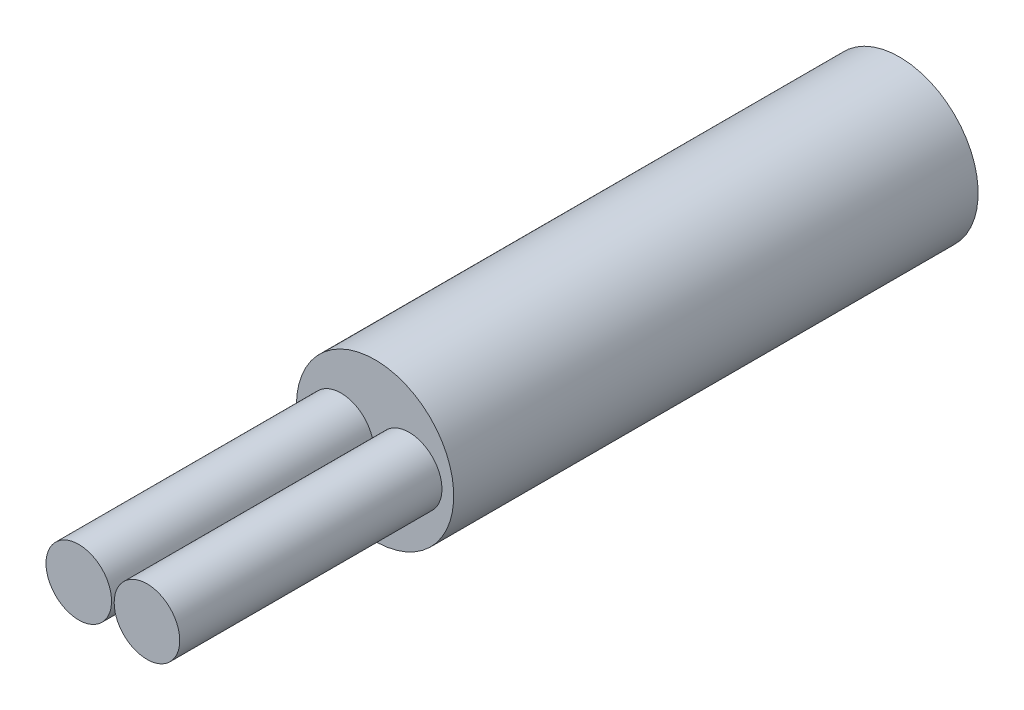
ISO-10303-21;
HEADER;
FILE_DESCRIPTION(('STEP AP214'),'2;1');
FILE_NAME('part.step','',(''),(''),'','','');
FILE_SCHEMA(('AUTOMOTIVE_DESIGN { 1 0 10303 214 1 1 1 1 }'));
ENDSEC;
DATA;
#1=APPLICATION_CONTEXT('core data for automotive mechanical design processes');
#2=APPLICATION_PROTOCOL_DEFINITION('international standard','automotive_design',2000,#1);
#3=PRODUCT_CONTEXT('',#1,'mechanical');
#4=PRODUCT('Part','Part','',(#3));
#5=PRODUCT_RELATED_PRODUCT_CATEGORY('part','',(#4));
#6=PRODUCT_DEFINITION_FORMATION('','',#4);
#7=PRODUCT_DEFINITION_CONTEXT('part definition',#1,'design');
#8=PRODUCT_DEFINITION('design','',#6,#7);
#9=PRODUCT_DEFINITION_SHAPE('','',#8);
#10=(LENGTH_UNIT() NAMED_UNIT(*) SI_UNIT(.MILLI.,.METRE.));
#11=(NAMED_UNIT(*) PLANE_ANGLE_UNIT() SI_UNIT($,.RADIAN.));
#12=(NAMED_UNIT(*) SI_UNIT($,.STERADIAN.) SOLID_ANGLE_UNIT());
#13=UNCERTAINTY_MEASURE_WITH_UNIT(LENGTH_MEASURE(1.E-05),#10,'distance_accuracy_value','');
#14=(GEOMETRIC_REPRESENTATION_CONTEXT(3) GLOBAL_UNCERTAINTY_ASSIGNED_CONTEXT((#13)) GLOBAL_UNIT_ASSIGNED_CONTEXT((#10,
#11,#12)) REPRESENTATION_CONTEXT('',''));
#15=CARTESIAN_POINT('',(0.,0.,0.));
#16=DIRECTION('',(0.,0.,1.));
#17=DIRECTION('',(1.,0.,0.));
#18=AXIS2_PLACEMENT_3D('',#15,#16,#17);
#19=CARTESIAN_POINT('',(0.,0.,0.));
#20=DIRECTION('',(0.,0.,-1.));
#21=DIRECTION('',(-1.,0.,0.));
#22=AXIS2_PLACEMENT_3D('',#19,#20,#21);
#23=CYLINDRICAL_SURFACE('',#22,3.);
#24=CARTESIAN_POINT('',(0.,0.,0.));
#25=DIRECTION('',(0.,0.,-1.));
#26=DIRECTION('',(-1.,0.,0.));
#27=AXIS2_PLACEMENT_3D('',#24,#25,#26);
#28=CIRCLE('',#27,3.);
#29=CARTESIAN_POINT('',(-3.,0.,0.));
#30=VERTEX_POINT('',#29);
#31=EDGE_CURVE('P0_E10',#30,#30,#28,.T.);
#32=ORIENTED_EDGE('',*,*,#31,.T.);
#33=EDGE_LOOP('',(#32));
#34=FACE_BOUND('',#33,.T.);
#35=CARTESIAN_POINT('',(0.,0.,-20.));
#36=DIRECTION('',(0.,0.,-1.));
#37=DIRECTION('',(-1.,0.,0.));
#38=AXIS2_PLACEMENT_3D('',#35,#36,#37);
#39=CIRCLE('',#38,3.);
#40=CARTESIAN_POINT('',(-3.,0.,-20.));
#41=VERTEX_POINT('',#40);
#42=EDGE_CURVE('P0_E37',#41,#41,#39,.T.);
#43=ORIENTED_EDGE('',*,*,#42,.F.);
#44=EDGE_LOOP('',(#43));
#45=FACE_BOUND('',#44,.T.);
#46=ADVANCED_FACE('P0_F31',(#34,#45),#23,.T.);
#47=CARTESIAN_POINT('',(3.,0.,0.));
#48=DIRECTION('',(0.,0.,1.));
#49=DIRECTION('',(1.,0.,0.));
#50=AXIS2_PLACEMENT_3D('',#47,#48,#49);
#51=PLANE('',#50);
#52=ORIENTED_EDGE('',*,*,#31,.F.);
#53=EDGE_LOOP('',(#52));
#54=FACE_BOUND('',#53,.T.);
#55=ADVANCED_FACE('P0_F46',(#54),#51,.T.);
#56=CARTESIAN_POINT('',(0.,0.,-20.));
#57=DIRECTION('',(0.,0.,-1.));
#58=DIRECTION('',(-1.,0.,0.));
#59=AXIS2_PLACEMENT_3D('',#56,#57,#58);
#60=PLANE('',#59);
#61=ORIENTED_EDGE('',*,*,#42,.T.);
#62=EDGE_LOOP('',(#61));
#63=FACE_BOUND('',#62,.T.);
#64=ADVANCED_FACE('P0_F43',(#63),#60,.T.);
#65=CLOSED_SHELL('',(#46,#55,#64));
#66=MANIFOLD_SOLID_BREP('P0_B2',#65);
#67=CARTESIAN_POINT('',(1.3,0.,10.));
#68=DIRECTION('',(0.,0.,-1.));
#69=DIRECTION('',(-1.,0.,0.));
#70=AXIS2_PLACEMENT_3D('',#67,#68,#69);
#71=PLANE('',#70);
#72=CARTESIAN_POINT('',(1.3,0.,10.));
#73=DIRECTION('',(0.,0.,-1.));
#74=DIRECTION('',(-1.,0.,0.));
#75=AXIS2_PLACEMENT_3D('',#72,#73,#74);
#76=CIRCLE('',#75,1.25);
#77=CARTESIAN_POINT('',(0.0500000000000008,0.,10.));
#78=VERTEX_POINT('',#77);
#79=EDGE_CURVE('P1_E18',#78,#78,#76,.T.);
#80=ORIENTED_EDGE('',*,*,#79,.F.);
#81=EDGE_LOOP('',(#80));
#82=FACE_BOUND('',#81,.T.);
#83=ADVANCED_FACE('P1_F15',(#82),#71,.F.);
#84=CARTESIAN_POINT('',(1.3,0.,0.));
#85=DIRECTION('',(0.,0.,-1.));
#86=DIRECTION('',(-1.,0.,0.));
#87=AXIS2_PLACEMENT_3D('',#84,#85,#86);
#88=PLANE('',#87);
#89=CARTESIAN_POINT('',(1.3,0.,0.));
#90=DIRECTION('',(0.,0.,-1.));
#91=DIRECTION('',(-1.,0.,0.));
#92=AXIS2_PLACEMENT_3D('',#89,#90,#91);
#93=CIRCLE('',#92,1.25);
#94=CARTESIAN_POINT('',(0.0500000000000008,0.,0.));
#95=VERTEX_POINT('',#94);
#96=EDGE_CURVE('P1_E10',#95,#95,#93,.F.);
#97=ORIENTED_EDGE('',*,*,#96,.F.);
#98=EDGE_LOOP('',(#97));
#99=FACE_BOUND('',#98,.T.);
#100=ADVANCED_FACE('P1_F30',(#99),#88,.T.);
#101=CARTESIAN_POINT('',(1.3,0.,10.));
#102=DIRECTION('',(0.,0.,-1.));
#103=DIRECTION('',(-1.,0.,0.));
#104=AXIS2_PLACEMENT_3D('',#101,#102,#103);
#105=CYLINDRICAL_SURFACE('',#104,1.25);
#106=ORIENTED_EDGE('',*,*,#96,.T.);
#107=EDGE_LOOP('',(#106));
#108=FACE_BOUND('',#107,.T.);
#109=ORIENTED_EDGE('',*,*,#79,.T.);
#110=EDGE_LOOP('',(#109));
#111=FACE_BOUND('',#110,.T.);
#112=ADVANCED_FACE('P1_F27',(#108,#111),#105,.T.);
#113=CLOSED_SHELL('',(#83,#100,#112));
#114=MANIFOLD_SOLID_BREP('P1_B1',#113);
#115=CARTESIAN_POINT('',(-1.3,0.,10.));
#116=DIRECTION('',(0.,0.,1.));
#117=DIRECTION('',(1.,0.,0.));
#118=AXIS2_PLACEMENT_3D('',#115,#116,#117);
#119=PLANE('',#118);
#120=CARTESIAN_POINT('',(-1.3,0.,10.));
#121=DIRECTION('',(0.,0.,-1.));
#122=DIRECTION('',(-1.,0.,0.));
#123=AXIS2_PLACEMENT_3D('',#120,#121,#122);
#124=CIRCLE('',#123,1.25);
#125=CARTESIAN_POINT('',(-2.55,0.,10.));
#126=VERTEX_POINT('',#125);
#127=EDGE_CURVE('P2_E17',#126,#126,#124,.T.);
#128=ORIENTED_EDGE('',*,*,#127,.F.);
#129=EDGE_LOOP('',(#128));
#130=FACE_BOUND('',#129,.T.);
#131=ADVANCED_FACE('P2_F14',(#130),#119,.T.);
#132=CARTESIAN_POINT('',(-1.3,0.,0.));
#133=DIRECTION('',(0.,0.,1.));
#134=DIRECTION('',(1.,0.,0.));
#135=AXIS2_PLACEMENT_3D('',#132,#133,#134);
#136=PLANE('',#135);
#137=CARTESIAN_POINT('',(-1.3,0.,0.));
#138=DIRECTION('',(0.,0.,-1.));
#139=DIRECTION('',(-1.,0.,0.));
#140=AXIS2_PLACEMENT_3D('',#137,#138,#139);
#141=CIRCLE('',#140,1.25);
#142=CARTESIAN_POINT('',(-2.55,0.,0.));
#143=VERTEX_POINT('',#142);
#144=EDGE_CURVE('P2_E9',#143,#143,#141,.F.);
#145=ORIENTED_EDGE('',*,*,#144,.F.);
#146=EDGE_LOOP('',(#145));
#147=FACE_BOUND('',#146,.T.);
#148=ADVANCED_FACE('P2_F29',(#147),#136,.F.);
#149=CARTESIAN_POINT('',(-1.3,0.,10.));
#150=DIRECTION('',(0.,0.,-1.));
#151=DIRECTION('',(-1.,0.,0.));
#152=AXIS2_PLACEMENT_3D('',#149,#150,#151);
#153=CYLINDRICAL_SURFACE('',#152,1.25);
#154=ORIENTED_EDGE('',*,*,#144,.T.);
#155=EDGE_LOOP('',(#154));
#156=FACE_BOUND('',#155,.T.);
#157=ORIENTED_EDGE('',*,*,#127,.T.);
#158=EDGE_LOOP('',(#157));
#159=FACE_BOUND('',#158,.T.);
#160=ADVANCED_FACE('P2_F26',(#156,#159),#153,.T.);
#161=CLOSED_SHELL('',(#131,#148,#160));
#162=MANIFOLD_SOLID_BREP('P2_B1',#161);
#163=ADVANCED_BREP_SHAPE_REPRESENTATION('',(#18,#66,#114,#162),#14);
#164=SHAPE_DEFINITION_REPRESENTATION(#9,#163);
ENDSEC;
END-ISO-10303-21;
